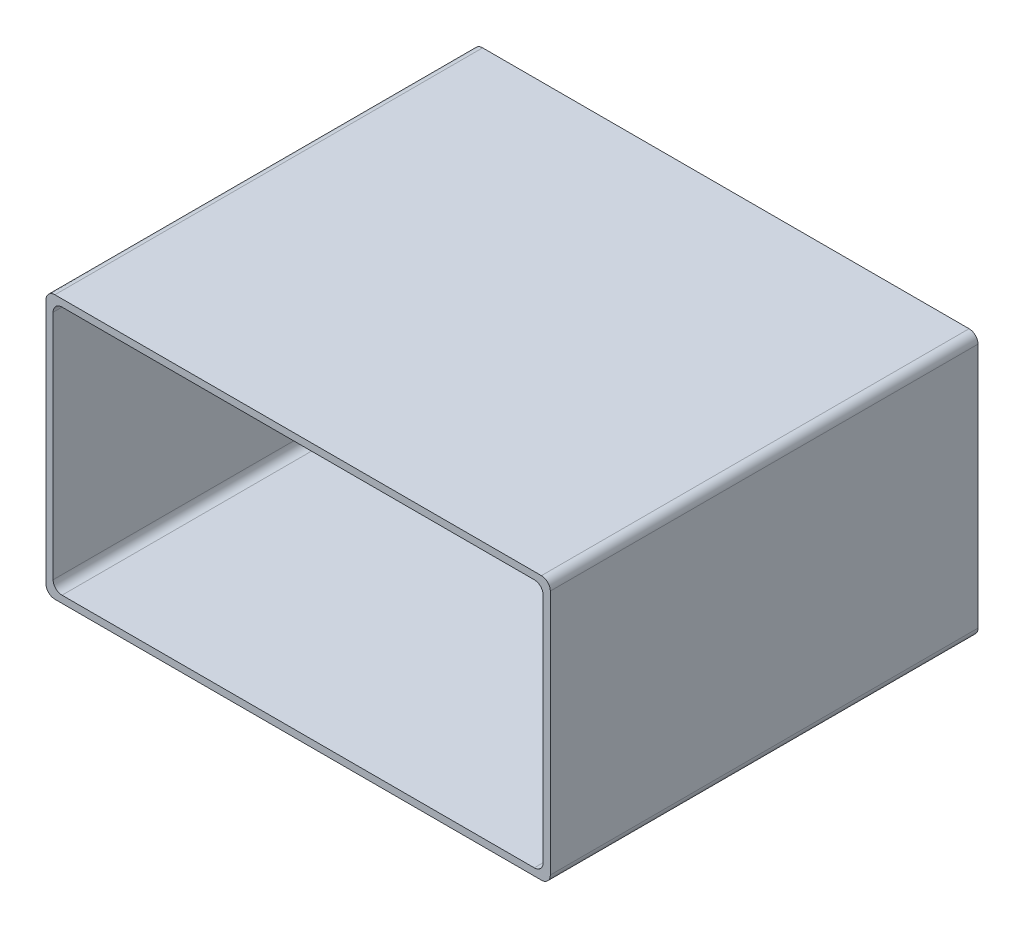
ISO-10303-21;
HEADER;
FILE_DESCRIPTION(('STEP AP214'),'2;1');
FILE_NAME('part.step','',(''),(''),'','','');
FILE_SCHEMA(('AUTOMOTIVE_DESIGN { 1 0 10303 214 1 1 1 1 }'));
ENDSEC;
DATA;
#1=APPLICATION_CONTEXT('core data for automotive mechanical design processes');
#2=APPLICATION_PROTOCOL_DEFINITION('international standard','automotive_design',2000,#1);
#3=PRODUCT_CONTEXT('',#1,'mechanical');
#4=PRODUCT('Part','Part','',(#3));
#5=PRODUCT_RELATED_PRODUCT_CATEGORY('part','',(#4));
#6=PRODUCT_DEFINITION_FORMATION('','',#4);
#7=PRODUCT_DEFINITION_CONTEXT('part definition',#1,'design');
#8=PRODUCT_DEFINITION('design','',#6,#7);
#9=PRODUCT_DEFINITION_SHAPE('','',#8);
#10=(LENGTH_UNIT() NAMED_UNIT(*) SI_UNIT(.MILLI.,.METRE.));
#11=(NAMED_UNIT(*) PLANE_ANGLE_UNIT() SI_UNIT($,.RADIAN.));
#12=(NAMED_UNIT(*) SI_UNIT($,.STERADIAN.) SOLID_ANGLE_UNIT());
#13=UNCERTAINTY_MEASURE_WITH_UNIT(LENGTH_MEASURE(1.E-05),#10,'distance_accuracy_value','');
#14=(GEOMETRIC_REPRESENTATION_CONTEXT(3) GLOBAL_UNCERTAINTY_ASSIGNED_CONTEXT((#13)) GLOBAL_UNIT_ASSIGNED_CONTEXT((#10,
#11,#12)) REPRESENTATION_CONTEXT('',''));
#15=CARTESIAN_POINT('',(0.,0.,0.));
#16=DIRECTION('',(0.,0.,1.));
#17=DIRECTION('',(1.,0.,0.));
#18=AXIS2_PLACEMENT_3D('',#15,#16,#17);
#19=CARTESIAN_POINT('',(0.,0.,48.));
#20=DIRECTION('',(0.,0.,1.));
#21=DIRECTION('',(1.,0.,0.));
#22=AXIS2_PLACEMENT_3D('',#19,#20,#21);
#23=PLANE('',#22);
#24=DIRECTION('',(1.,0.,0.));
#25=VECTOR('',#24,1.);
#26=CARTESIAN_POINT('',(-28.3,-14.8,48.));
#27=LINE('',#26,#25);
#28=CARTESIAN_POINT('',(-27.3,-14.8,48.));
#29=VERTEX_POINT('',#28);
#30=CARTESIAN_POINT('',(27.3,-14.8,48.));
#31=VERTEX_POINT('',#30);
#32=EDGE_CURVE('E271',#29,#31,#27,.T.);
#33=ORIENTED_EDGE('',*,*,#32,.T.);
#34=CARTESIAN_POINT('',(27.3,-13.8,48.));
#35=DIRECTION('',(0.,0.,1.));
#36=DIRECTION('',(1.,0.,0.));
#37=AXIS2_PLACEMENT_3D('',#34,#35,#36);
#38=CIRCLE('',#37,1.);
#39=CARTESIAN_POINT('',(28.3,-13.8,48.));
#40=VERTEX_POINT('',#39);
#41=EDGE_CURVE('E218',#31,#40,#38,.T.);
#42=ORIENTED_EDGE('',*,*,#41,.T.);
#43=DIRECTION('',(0.,1.,0.));
#44=VECTOR('',#43,1.);
#45=CARTESIAN_POINT('',(28.3,14.8,48.));
#46=LINE('',#45,#44);
#47=CARTESIAN_POINT('',(28.3,13.8,48.));
#48=VERTEX_POINT('',#47);
#49=EDGE_CURVE('E176',#40,#48,#46,.T.);
#50=ORIENTED_EDGE('',*,*,#49,.T.);
#51=CARTESIAN_POINT('',(27.3,13.8,48.));
#52=DIRECTION('',(0.,0.,1.));
#53=DIRECTION('',(1.,0.,0.));
#54=AXIS2_PLACEMENT_3D('',#51,#52,#53);
#55=CIRCLE('',#54,1.);
#56=CARTESIAN_POINT('',(27.3,14.8,48.));
#57=VERTEX_POINT('',#56);
#58=EDGE_CURVE('E57',#48,#57,#55,.T.);
#59=ORIENTED_EDGE('',*,*,#58,.T.);
#60=DIRECTION('',(-1.,0.,0.));
#61=VECTOR('',#60,1.);
#62=CARTESIAN_POINT('',(-28.3,14.8,48.));
#63=LINE('',#62,#61);
#64=CARTESIAN_POINT('',(-27.3,14.8,48.));
#65=VERTEX_POINT('',#64);
#66=EDGE_CURVE('E172',#57,#65,#63,.T.);
#67=ORIENTED_EDGE('',*,*,#66,.T.);
#68=CARTESIAN_POINT('',(-27.3,13.8,48.));
#69=DIRECTION('',(0.,0.,1.));
#70=DIRECTION('',(1.,0.,0.));
#71=AXIS2_PLACEMENT_3D('',#68,#69,#70);
#72=CIRCLE('',#71,1.);
#73=CARTESIAN_POINT('',(-28.3,13.8,48.));
#74=VERTEX_POINT('',#73);
#75=EDGE_CURVE('E214',#65,#74,#72,.T.);
#76=ORIENTED_EDGE('',*,*,#75,.T.);
#77=DIRECTION('',(0.,-1.,0.));
#78=VECTOR('',#77,1.);
#79=CARTESIAN_POINT('',(-28.3,14.8,48.));
#80=LINE('',#79,#78);
#81=CARTESIAN_POINT('',(-28.3,-13.8,48.));
#82=VERTEX_POINT('',#81);
#83=EDGE_CURVE('E268',#74,#82,#80,.T.);
#84=ORIENTED_EDGE('',*,*,#83,.T.);
#85=CARTESIAN_POINT('',(-27.3,-13.8,48.));
#86=DIRECTION('',(0.,0.,1.));
#87=DIRECTION('',(1.,0.,0.));
#88=AXIS2_PLACEMENT_3D('',#85,#86,#87);
#89=CIRCLE('',#88,1.);
#90=EDGE_CURVE('E216',#82,#29,#89,.T.);
#91=ORIENTED_EDGE('',*,*,#90,.T.);
#92=EDGE_LOOP('',(#33,#42,#50,#59,#67,#76,#84,#91));
#93=FACE_BOUND('',#92,.T.);
#94=DIRECTION('',(-1.,0.,0.));
#95=VECTOR('',#94,1.);
#96=CARTESIAN_POINT('',(-27.5,14.,48.));
#97=LINE('',#96,#95);
#98=CARTESIAN_POINT('',(26.5,14.,48.));
#99=VERTEX_POINT('',#98);
#100=CARTESIAN_POINT('',(-26.5,14.,48.));
#101=VERTEX_POINT('',#100);
#102=EDGE_CURVE('E467',#99,#101,#97,.T.);
#103=ORIENTED_EDGE('',*,*,#102,.F.);
#104=CARTESIAN_POINT('',(26.5,13.,48.));
#105=DIRECTION('',(0.,0.,1.));
#106=DIRECTION('',(1.,0.,0.));
#107=AXIS2_PLACEMENT_3D('',#104,#105,#106);
#108=CIRCLE('',#107,1.);
#109=CARTESIAN_POINT('',(27.5,13.,48.));
#110=VERTEX_POINT('',#109);
#111=EDGE_CURVE('E11',#99,#110,#108,.F.);
#112=ORIENTED_EDGE('',*,*,#111,.T.);
#113=DIRECTION('',(0.,1.,0.));
#114=VECTOR('',#113,1.);
#115=CARTESIAN_POINT('',(27.5,14.,48.));
#116=LINE('',#115,#114);
#117=CARTESIAN_POINT('',(27.5,-13.,48.));
#118=VERTEX_POINT('',#117);
#119=EDGE_CURVE('E247',#118,#110,#116,.T.);
#120=ORIENTED_EDGE('',*,*,#119,.F.);
#121=CARTESIAN_POINT('',(26.5,-13.,48.));
#122=DIRECTION('',(0.,0.,1.));
#123=DIRECTION('',(1.,0.,0.));
#124=AXIS2_PLACEMENT_3D('',#121,#122,#123);
#125=CIRCLE('',#124,1.);
#126=CARTESIAN_POINT('',(26.5,-14.,48.));
#127=VERTEX_POINT('',#126);
#128=EDGE_CURVE('E159',#118,#127,#125,.F.);
#129=ORIENTED_EDGE('',*,*,#128,.T.);
#130=DIRECTION('',(1.,0.,0.));
#131=VECTOR('',#130,1.);
#132=CARTESIAN_POINT('',(-27.5,-14.,48.));
#133=LINE('',#132,#131);
#134=CARTESIAN_POINT('',(-26.5,-14.,48.));
#135=VERTEX_POINT('',#134);
#136=EDGE_CURVE('E244',#135,#127,#133,.T.);
#137=ORIENTED_EDGE('',*,*,#136,.F.);
#138=CARTESIAN_POINT('',(-26.5,-13.,48.));
#139=DIRECTION('',(0.,0.,1.));
#140=DIRECTION('',(1.,0.,0.));
#141=AXIS2_PLACEMENT_3D('',#138,#139,#140);
#142=CIRCLE('',#141,1.);
#143=CARTESIAN_POINT('',(-27.5,-13.,48.));
#144=VERTEX_POINT('',#143);
#145=EDGE_CURVE('E235',#135,#144,#142,.F.);
#146=ORIENTED_EDGE('',*,*,#145,.T.);
#147=DIRECTION('',(0.,-1.,0.));
#148=VECTOR('',#147,1.);
#149=CARTESIAN_POINT('',(-27.5,14.,48.));
#150=LINE('',#149,#148);
#151=CARTESIAN_POINT('',(-27.5,13.,48.));
#152=VERTEX_POINT('',#151);
#153=EDGE_CURVE('E256',#152,#144,#150,.T.);
#154=ORIENTED_EDGE('',*,*,#153,.F.);
#155=CARTESIAN_POINT('',(-26.5,13.,48.));
#156=DIRECTION('',(0.,0.,1.));
#157=DIRECTION('',(1.,0.,0.));
#158=AXIS2_PLACEMENT_3D('',#155,#156,#157);
#159=CIRCLE('',#158,1.);
#160=EDGE_CURVE('E231',#152,#101,#159,.F.);
#161=ORIENTED_EDGE('',*,*,#160,.T.);
#162=EDGE_LOOP('',(#103,#112,#120,#129,#137,#146,#154,#161));
#163=FACE_BOUND('',#162,.T.);
#164=ADVANCED_FACE('F35',(#93,#163),#23,.T.);
#165=CARTESIAN_POINT('',(0.,0.,0.));
#166=DIRECTION('',(0.,0.,1.));
#167=DIRECTION('',(1.,0.,0.));
#168=AXIS2_PLACEMENT_3D('',#165,#166,#167);
#169=PLANE('',#168);
#170=DIRECTION('',(0.,1.,0.));
#171=VECTOR('',#170,1.);
#172=CARTESIAN_POINT('',(28.3,14.8,0.));
#173=LINE('',#172,#171);
#174=CARTESIAN_POINT('',(28.3,-13.8,0.));
#175=VERTEX_POINT('',#174);
#176=CARTESIAN_POINT('',(28.3,13.8,0.));
#177=VERTEX_POINT('',#176);
#178=EDGE_CURVE('E279',#175,#177,#173,.T.);
#179=ORIENTED_EDGE('',*,*,#178,.F.);
#180=CARTESIAN_POINT('',(27.3,-13.8,0.));
#181=DIRECTION('',(0.,0.,1.));
#182=DIRECTION('',(1.,0.,0.));
#183=AXIS2_PLACEMENT_3D('',#180,#181,#182);
#184=CIRCLE('',#183,1.);
#185=CARTESIAN_POINT('',(27.3,-14.8,0.));
#186=VERTEX_POINT('',#185);
#187=EDGE_CURVE('E206',#175,#186,#184,.F.);
#188=ORIENTED_EDGE('',*,*,#187,.T.);
#189=DIRECTION('',(1.,0.,0.));
#190=VECTOR('',#189,1.);
#191=CARTESIAN_POINT('',(-28.3,-14.8,0.));
#192=LINE('',#191,#190);
#193=CARTESIAN_POINT('',(-27.3,-14.8,0.));
#194=VERTEX_POINT('',#193);
#195=EDGE_CURVE('E277',#194,#186,#192,.T.);
#196=ORIENTED_EDGE('',*,*,#195,.F.);
#197=CARTESIAN_POINT('',(-27.3,-13.8,0.));
#198=DIRECTION('',(0.,0.,1.));
#199=DIRECTION('',(1.,0.,0.));
#200=AXIS2_PLACEMENT_3D('',#197,#198,#199);
#201=CIRCLE('',#200,1.);
#202=CARTESIAN_POINT('',(-28.3,-13.8,0.));
#203=VERTEX_POINT('',#202);
#204=EDGE_CURVE('E204',#194,#203,#201,.F.);
#205=ORIENTED_EDGE('',*,*,#204,.T.);
#206=DIRECTION('',(0.,-1.,0.));
#207=VECTOR('',#206,1.);
#208=CARTESIAN_POINT('',(-28.3,14.8,0.));
#209=LINE('',#208,#207);
#210=CARTESIAN_POINT('',(-28.3,13.8,0.));
#211=VERTEX_POINT('',#210);
#212=EDGE_CURVE('E255',#211,#203,#209,.T.);
#213=ORIENTED_EDGE('',*,*,#212,.F.);
#214=CARTESIAN_POINT('',(-27.3,13.8,0.));
#215=DIRECTION('',(0.,0.,1.));
#216=DIRECTION('',(1.,0.,0.));
#217=AXIS2_PLACEMENT_3D('',#214,#215,#216);
#218=CIRCLE('',#217,1.);
#219=CARTESIAN_POINT('',(-27.3,14.8,0.));
#220=VERTEX_POINT('',#219);
#221=EDGE_CURVE('E202',#211,#220,#218,.F.);
#222=ORIENTED_EDGE('',*,*,#221,.T.);
#223=DIRECTION('',(-1.,0.,0.));
#224=VECTOR('',#223,1.);
#225=CARTESIAN_POINT('',(-28.3,14.8,0.));
#226=LINE('',#225,#224);
#227=CARTESIAN_POINT('',(27.3,14.8,0.));
#228=VERTEX_POINT('',#227);
#229=EDGE_CURVE('E179',#228,#220,#226,.T.);
#230=ORIENTED_EDGE('',*,*,#229,.F.);
#231=CARTESIAN_POINT('',(27.3,13.8,0.));
#232=DIRECTION('',(0.,0.,1.));
#233=DIRECTION('',(1.,0.,0.));
#234=AXIS2_PLACEMENT_3D('',#231,#232,#233);
#235=CIRCLE('',#234,1.);
#236=EDGE_CURVE('E200',#228,#177,#235,.F.);
#237=ORIENTED_EDGE('',*,*,#236,.T.);
#238=EDGE_LOOP('',(#179,#188,#196,#205,#213,#222,#230,#237));
#239=FACE_BOUND('',#238,.T.);
#240=DIRECTION('',(1.,0.,0.));
#241=VECTOR('',#240,1.);
#242=CARTESIAN_POINT('',(-27.5,-14.,0.));
#243=LINE('',#242,#241);
#244=CARTESIAN_POINT('',(-26.5,-14.,0.));
#245=VERTEX_POINT('',#244);
#246=CARTESIAN_POINT('',(26.5,-14.,0.));
#247=VERTEX_POINT('',#246);
#248=EDGE_CURVE('E259',#245,#247,#243,.T.);
#249=ORIENTED_EDGE('',*,*,#248,.T.);
#250=CARTESIAN_POINT('',(26.5,-13.,0.));
#251=DIRECTION('',(0.,0.,1.));
#252=DIRECTION('',(1.,0.,0.));
#253=AXIS2_PLACEMENT_3D('',#250,#251,#252);
#254=CIRCLE('',#253,1.);
#255=CARTESIAN_POINT('',(27.5,-13.,0.));
#256=VERTEX_POINT('',#255);
#257=EDGE_CURVE('E237',#247,#256,#254,.T.);
#258=ORIENTED_EDGE('',*,*,#257,.T.);
#259=DIRECTION('',(0.,1.,0.));
#260=VECTOR('',#259,1.);
#261=CARTESIAN_POINT('',(27.5,14.,0.));
#262=LINE('',#261,#260);
#263=CARTESIAN_POINT('',(27.5,13.,0.));
#264=VERTEX_POINT('',#263);
#265=EDGE_CURVE('E154',#256,#264,#262,.T.);
#266=ORIENTED_EDGE('',*,*,#265,.T.);
#267=CARTESIAN_POINT('',(26.5,13.,0.));
#268=DIRECTION('',(0.,0.,1.));
#269=DIRECTION('',(1.,0.,0.));
#270=AXIS2_PLACEMENT_3D('',#267,#268,#269);
#271=CIRCLE('',#270,1.);
#272=CARTESIAN_POINT('',(26.5,14.,0.));
#273=VERTEX_POINT('',#272);
#274=EDGE_CURVE('E43',#264,#273,#271,.T.);
#275=ORIENTED_EDGE('',*,*,#274,.T.);
#276=DIRECTION('',(-1.,0.,0.));
#277=VECTOR('',#276,1.);
#278=CARTESIAN_POINT('',(-27.5,14.,0.));
#279=LINE('',#278,#277);
#280=CARTESIAN_POINT('',(-26.5,14.,0.));
#281=VERTEX_POINT('',#280);
#282=EDGE_CURVE('E152',#273,#281,#279,.T.);
#283=ORIENTED_EDGE('',*,*,#282,.T.);
#284=CARTESIAN_POINT('',(-26.5,13.,0.));
#285=DIRECTION('',(0.,0.,1.));
#286=DIRECTION('',(1.,0.,0.));
#287=AXIS2_PLACEMENT_3D('',#284,#285,#286);
#288=CIRCLE('',#287,1.);
#289=CARTESIAN_POINT('',(-27.5,13.,0.));
#290=VERTEX_POINT('',#289);
#291=EDGE_CURVE('E229',#281,#290,#288,.T.);
#292=ORIENTED_EDGE('',*,*,#291,.T.);
#293=DIRECTION('',(0.,-1.,0.));
#294=VECTOR('',#293,1.);
#295=CARTESIAN_POINT('',(-27.5,14.,0.));
#296=LINE('',#295,#294);
#297=CARTESIAN_POINT('',(-27.5,-13.,0.));
#298=VERTEX_POINT('',#297);
#299=EDGE_CURVE('E168',#290,#298,#296,.T.);
#300=ORIENTED_EDGE('',*,*,#299,.T.);
#301=CARTESIAN_POINT('',(-26.5,-13.,0.));
#302=DIRECTION('',(0.,0.,1.));
#303=DIRECTION('',(1.,0.,0.));
#304=AXIS2_PLACEMENT_3D('',#301,#302,#303);
#305=CIRCLE('',#304,1.);
#306=EDGE_CURVE('E233',#298,#245,#305,.T.);
#307=ORIENTED_EDGE('',*,*,#306,.T.);
#308=EDGE_LOOP('',(#249,#258,#266,#275,#283,#292,#300,#307));
#309=FACE_BOUND('',#308,.T.);
#310=ADVANCED_FACE('F151',(#239,#309),#169,.F.);
#311=CARTESIAN_POINT('',(-28.3,14.8,48.));
#312=DIRECTION('',(1.,0.,0.));
#313=DIRECTION('',(0.,1.,0.));
#314=AXIS2_PLACEMENT_3D('',#311,#312,#313);
#315=PLANE('',#314);
#316=ORIENTED_EDGE('',*,*,#212,.T.);
#317=DIRECTION('',(0.,0.,-1.));
#318=VECTOR('',#317,1.);
#319=CARTESIAN_POINT('',(-28.3,-13.8,48.));
#320=LINE('',#319,#318);
#321=EDGE_CURVE('E223',#203,#82,#320,.F.);
#322=ORIENTED_EDGE('',*,*,#321,.T.);
#323=ORIENTED_EDGE('',*,*,#83,.F.);
#324=DIRECTION('',(0.,0.,-1.));
#325=VECTOR('',#324,1.);
#326=CARTESIAN_POINT('',(-28.3,13.8,48.));
#327=LINE('',#326,#325);
#328=EDGE_CURVE('E220',#74,#211,#327,.T.);
#329=ORIENTED_EDGE('',*,*,#328,.T.);
#330=EDGE_LOOP('',(#316,#322,#323,#329));
#331=FACE_BOUND('',#330,.T.);
#332=ADVANCED_FACE('F295',(#331),#315,.F.);
#333=CARTESIAN_POINT('',(-28.3,-14.8,48.));
#334=DIRECTION('',(0.,1.,0.));
#335=DIRECTION('',(0.,0.,1.));
#336=AXIS2_PLACEMENT_3D('',#333,#334,#335);
#337=PLANE('',#336);
#338=ORIENTED_EDGE('',*,*,#195,.T.);
#339=DIRECTION('',(0.,0.,-1.));
#340=VECTOR('',#339,1.);
#341=CARTESIAN_POINT('',(27.3,-14.8,48.));
#342=LINE('',#341,#340);
#343=EDGE_CURVE('E211',#186,#31,#342,.F.);
#344=ORIENTED_EDGE('',*,*,#343,.T.);
#345=ORIENTED_EDGE('',*,*,#32,.F.);
#346=DIRECTION('',(0.,0.,-1.));
#347=VECTOR('',#346,1.);
#348=CARTESIAN_POINT('',(-27.3,-14.8,48.));
#349=LINE('',#348,#347);
#350=EDGE_CURVE('E208',#29,#194,#349,.T.);
#351=ORIENTED_EDGE('',*,*,#350,.T.);
#352=EDGE_LOOP('',(#338,#344,#345,#351));
#353=FACE_BOUND('',#352,.T.);
#354=ADVANCED_FACE('F304',(#353),#337,.F.);
#355=CARTESIAN_POINT('',(28.3,14.8,48.));
#356=DIRECTION('',(-1.,0.,0.));
#357=DIRECTION('',(0.,-1.,0.));
#358=AXIS2_PLACEMENT_3D('',#355,#356,#357);
#359=PLANE('',#358);
#360=ORIENTED_EDGE('',*,*,#49,.F.);
#361=DIRECTION('',(0.,0.,-1.));
#362=VECTOR('',#361,1.);
#363=CARTESIAN_POINT('',(28.3,-13.8,48.));
#364=LINE('',#363,#362);
#365=EDGE_CURVE('E197',#40,#175,#364,.T.);
#366=ORIENTED_EDGE('',*,*,#365,.T.);
#367=ORIENTED_EDGE('',*,*,#178,.T.);
#368=DIRECTION('',(0.,0.,-1.));
#369=VECTOR('',#368,1.);
#370=CARTESIAN_POINT('',(28.3,13.8,48.));
#371=LINE('',#370,#369);
#372=EDGE_CURVE('E195',#177,#48,#371,.F.);
#373=ORIENTED_EDGE('',*,*,#372,.T.);
#374=EDGE_LOOP('',(#360,#366,#367,#373));
#375=FACE_BOUND('',#374,.T.);
#376=ADVANCED_FACE('F311',(#375),#359,.F.);
#377=CARTESIAN_POINT('',(-28.3,14.8,48.));
#378=DIRECTION('',(0.,-1.,0.));
#379=DIRECTION('',(0.,0.,-1.));
#380=AXIS2_PLACEMENT_3D('',#377,#378,#379);
#381=PLANE('',#380);
#382=ORIENTED_EDGE('',*,*,#229,.T.);
#383=DIRECTION('',(0.,0.,-1.));
#384=VECTOR('',#383,1.);
#385=CARTESIAN_POINT('',(-27.3,14.8,48.));
#386=LINE('',#385,#384);
#387=EDGE_CURVE('E50',#220,#65,#386,.F.);
#388=ORIENTED_EDGE('',*,*,#387,.T.);
#389=ORIENTED_EDGE('',*,*,#66,.F.);
#390=DIRECTION('',(0.,0.,-1.));
#391=VECTOR('',#390,1.);
#392=CARTESIAN_POINT('',(27.3,14.8,48.));
#393=LINE('',#392,#391);
#394=EDGE_CURVE('E225',#57,#228,#393,.T.);
#395=ORIENTED_EDGE('',*,*,#394,.T.);
#396=EDGE_LOOP('',(#382,#388,#389,#395));
#397=FACE_BOUND('',#396,.T.);
#398=ADVANCED_FACE('F285',(#397),#381,.F.);
#399=CARTESIAN_POINT('',(27.5,14.,48.));
#400=DIRECTION('',(-1.,0.,0.));
#401=DIRECTION('',(0.,-1.,0.));
#402=AXIS2_PLACEMENT_3D('',#399,#400,#401);
#403=PLANE('',#402);
#404=ORIENTED_EDGE('',*,*,#265,.F.);
#405=DIRECTION('',(0.,0.,-1.));
#406=VECTOR('',#405,1.);
#407=CARTESIAN_POINT('',(27.5,-13.,48.));
#408=LINE('',#407,#406);
#409=EDGE_CURVE('E193',#256,#118,#408,.F.);
#410=ORIENTED_EDGE('',*,*,#409,.T.);
#411=ORIENTED_EDGE('',*,*,#119,.T.);
#412=DIRECTION('',(0.,0.,-1.));
#413=VECTOR('',#412,1.);
#414=CARTESIAN_POINT('',(27.5,13.,0.));
#415=LINE('',#414,#413);
#416=EDGE_CURVE('E191',#110,#264,#415,.T.);
#417=ORIENTED_EDGE('',*,*,#416,.T.);
#418=EDGE_LOOP('',(#404,#410,#411,#417));
#419=FACE_BOUND('',#418,.T.);
#420=ADVANCED_FACE('F261',(#419),#403,.T.);
#421=CARTESIAN_POINT('',(-27.5,14.,48.));
#422=DIRECTION('',(0.,-1.,0.));
#423=DIRECTION('',(0.,0.,-1.));
#424=AXIS2_PLACEMENT_3D('',#421,#422,#423);
#425=PLANE('',#424);
#426=ORIENTED_EDGE('',*,*,#102,.T.);
#427=DIRECTION('',(0.,0.,-1.));
#428=VECTOR('',#427,1.);
#429=CARTESIAN_POINT('',(-26.5,14.,0.));
#430=LINE('',#429,#428);
#431=EDGE_CURVE('E167',#101,#281,#430,.T.);
#432=ORIENTED_EDGE('',*,*,#431,.T.);
#433=ORIENTED_EDGE('',*,*,#282,.F.);
#434=DIRECTION('',(0.,0.,-1.));
#435=VECTOR('',#434,1.);
#436=CARTESIAN_POINT('',(26.5,14.,48.));
#437=LINE('',#436,#435);
#438=EDGE_CURVE('E164',#273,#99,#437,.F.);
#439=ORIENTED_EDGE('',*,*,#438,.T.);
#440=EDGE_LOOP('',(#426,#432,#433,#439));
#441=FACE_BOUND('',#440,.T.);
#442=ADVANCED_FACE('F163',(#441),#425,.T.);
#443=CARTESIAN_POINT('',(-27.5,14.,48.));
#444=DIRECTION('',(1.,0.,0.));
#445=DIRECTION('',(0.,1.,0.));
#446=AXIS2_PLACEMENT_3D('',#443,#444,#445);
#447=PLANE('',#446);
#448=ORIENTED_EDGE('',*,*,#299,.F.);
#449=DIRECTION('',(0.,0.,-1.));
#450=VECTOR('',#449,1.);
#451=CARTESIAN_POINT('',(-27.5,13.,48.));
#452=LINE('',#451,#450);
#453=EDGE_CURVE('E184',#290,#152,#452,.F.);
#454=ORIENTED_EDGE('',*,*,#453,.T.);
#455=ORIENTED_EDGE('',*,*,#153,.T.);
#456=DIRECTION('',(0.,0.,-1.));
#457=VECTOR('',#456,1.);
#458=CARTESIAN_POINT('',(-27.5,-13.,0.));
#459=LINE('',#458,#457);
#460=EDGE_CURVE('E174',#144,#298,#459,.T.);
#461=ORIENTED_EDGE('',*,*,#460,.T.);
#462=EDGE_LOOP('',(#448,#454,#455,#461));
#463=FACE_BOUND('',#462,.T.);
#464=ADVANCED_FACE('F399',(#463),#447,.T.);
#465=CARTESIAN_POINT('',(-27.5,-14.,48.));
#466=DIRECTION('',(0.,1.,0.));
#467=DIRECTION('',(0.,0.,1.));
#468=AXIS2_PLACEMENT_3D('',#465,#466,#467);
#469=PLANE('',#468);
#470=ORIENTED_EDGE('',*,*,#248,.F.);
#471=DIRECTION('',(0.,0.,-1.));
#472=VECTOR('',#471,1.);
#473=CARTESIAN_POINT('',(-26.5,-14.,48.));
#474=LINE('',#473,#472);
#475=EDGE_CURVE('E189',#245,#135,#474,.F.);
#476=ORIENTED_EDGE('',*,*,#475,.T.);
#477=ORIENTED_EDGE('',*,*,#136,.T.);
#478=DIRECTION('',(0.,0.,-1.));
#479=VECTOR('',#478,1.);
#480=CARTESIAN_POINT('',(26.5,-14.,0.));
#481=LINE('',#480,#479);
#482=EDGE_CURVE('E186',#127,#247,#481,.T.);
#483=ORIENTED_EDGE('',*,*,#482,.T.);
#484=EDGE_LOOP('',(#470,#476,#477,#483));
#485=FACE_BOUND('',#484,.T.);
#486=ADVANCED_FACE('F253',(#485),#469,.T.);
#487=CARTESIAN_POINT('',(-26.5,13.,48.));
#488=DIRECTION('',(0.,0.,1.));
#489=DIRECTION('',(1.,0.,0.));
#490=AXIS2_PLACEMENT_3D('',#487,#488,#489);
#491=CYLINDRICAL_SURFACE('',#490,1.);
#492=ORIENTED_EDGE('',*,*,#160,.F.);
#493=ORIENTED_EDGE('',*,*,#453,.F.);
#494=ORIENTED_EDGE('',*,*,#291,.F.);
#495=ORIENTED_EDGE('',*,*,#431,.F.);
#496=EDGE_LOOP('',(#492,#493,#494,#495));
#497=FACE_BOUND('',#496,.T.);
#498=ADVANCED_FACE('F329',(#497),#491,.F.);
#499=CARTESIAN_POINT('',(-26.5,-13.,48.));
#500=DIRECTION('',(0.,0.,1.));
#501=DIRECTION('',(1.,0.,0.));
#502=AXIS2_PLACEMENT_3D('',#499,#500,#501);
#503=CYLINDRICAL_SURFACE('',#502,1.);
#504=ORIENTED_EDGE('',*,*,#145,.F.);
#505=ORIENTED_EDGE('',*,*,#475,.F.);
#506=ORIENTED_EDGE('',*,*,#306,.F.);
#507=ORIENTED_EDGE('',*,*,#460,.F.);
#508=EDGE_LOOP('',(#504,#505,#506,#507));
#509=FACE_BOUND('',#508,.T.);
#510=ADVANCED_FACE('F332',(#509),#503,.F.);
#511=CARTESIAN_POINT('',(26.5,-13.,48.));
#512=DIRECTION('',(0.,0.,1.));
#513=DIRECTION('',(1.,0.,0.));
#514=AXIS2_PLACEMENT_3D('',#511,#512,#513);
#515=CYLINDRICAL_SURFACE('',#514,1.);
#516=ORIENTED_EDGE('',*,*,#128,.F.);
#517=ORIENTED_EDGE('',*,*,#409,.F.);
#518=ORIENTED_EDGE('',*,*,#257,.F.);
#519=ORIENTED_EDGE('',*,*,#482,.F.);
#520=EDGE_LOOP('',(#516,#517,#518,#519));
#521=FACE_BOUND('',#520,.T.);
#522=ADVANCED_FACE('F258',(#521),#515,.F.);
#523=CARTESIAN_POINT('',(26.5,13.,48.));
#524=DIRECTION('',(0.,0.,1.));
#525=DIRECTION('',(1.,0.,0.));
#526=AXIS2_PLACEMENT_3D('',#523,#524,#525);
#527=CYLINDRICAL_SURFACE('',#526,1.);
#528=ORIENTED_EDGE('',*,*,#111,.F.);
#529=ORIENTED_EDGE('',*,*,#438,.F.);
#530=ORIENTED_EDGE('',*,*,#274,.F.);
#531=ORIENTED_EDGE('',*,*,#416,.F.);
#532=EDGE_LOOP('',(#528,#529,#530,#531));
#533=FACE_BOUND('',#532,.T.);
#534=ADVANCED_FACE('F171',(#533),#527,.F.);
#535=CARTESIAN_POINT('',(27.3,-13.8,48.));
#536=DIRECTION('',(0.,0.,-1.));
#537=DIRECTION('',(-1.,0.,0.));
#538=AXIS2_PLACEMENT_3D('',#535,#536,#537);
#539=CYLINDRICAL_SURFACE('',#538,1.);
#540=ORIENTED_EDGE('',*,*,#41,.F.);
#541=ORIENTED_EDGE('',*,*,#343,.F.);
#542=ORIENTED_EDGE('',*,*,#187,.F.);
#543=ORIENTED_EDGE('',*,*,#365,.F.);
#544=EDGE_LOOP('',(#540,#541,#542,#543));
#545=FACE_BOUND('',#544,.T.);
#546=ADVANCED_FACE('F308',(#545),#539,.T.);
#547=CARTESIAN_POINT('',(-27.3,-13.8,48.));
#548=DIRECTION('',(0.,0.,-1.));
#549=DIRECTION('',(-1.,0.,0.));
#550=AXIS2_PLACEMENT_3D('',#547,#548,#549);
#551=CYLINDRICAL_SURFACE('',#550,1.);
#552=ORIENTED_EDGE('',*,*,#90,.F.);
#553=ORIENTED_EDGE('',*,*,#321,.F.);
#554=ORIENTED_EDGE('',*,*,#204,.F.);
#555=ORIENTED_EDGE('',*,*,#350,.F.);
#556=EDGE_LOOP('',(#552,#553,#554,#555));
#557=FACE_BOUND('',#556,.T.);
#558=ADVANCED_FACE('F299',(#557),#551,.T.);
#559=CARTESIAN_POINT('',(-27.3,13.8,48.));
#560=DIRECTION('',(0.,0.,-1.));
#561=DIRECTION('',(-1.,0.,0.));
#562=AXIS2_PLACEMENT_3D('',#559,#560,#561);
#563=CYLINDRICAL_SURFACE('',#562,1.);
#564=ORIENTED_EDGE('',*,*,#75,.F.);
#565=ORIENTED_EDGE('',*,*,#387,.F.);
#566=ORIENTED_EDGE('',*,*,#221,.F.);
#567=ORIENTED_EDGE('',*,*,#328,.F.);
#568=EDGE_LOOP('',(#564,#565,#566,#567));
#569=FACE_BOUND('',#568,.T.);
#570=ADVANCED_FACE('F290',(#569),#563,.T.);
#571=CARTESIAN_POINT('',(27.3,13.8,48.));
#572=DIRECTION('',(0.,0.,-1.));
#573=DIRECTION('',(-1.,0.,0.));
#574=AXIS2_PLACEMENT_3D('',#571,#572,#573);
#575=CYLINDRICAL_SURFACE('',#574,1.);
#576=ORIENTED_EDGE('',*,*,#58,.F.);
#577=ORIENTED_EDGE('',*,*,#372,.F.);
#578=ORIENTED_EDGE('',*,*,#236,.F.);
#579=ORIENTED_EDGE('',*,*,#394,.F.);
#580=EDGE_LOOP('',(#576,#577,#578,#579));
#581=FACE_BOUND('',#580,.T.);
#582=ADVANCED_FACE('F37',(#581),#575,.T.);
#583=CLOSED_SHELL('',(#164,#310,#332,#354,#376,#398,#420,#442,#464,#486,#498,#510,#522,#534,
#546,#558,#570,#582));
#584=MANIFOLD_SOLID_BREP('B2',#583);
#585=ADVANCED_BREP_SHAPE_REPRESENTATION('',(#18,#584),#14);
#586=SHAPE_DEFINITION_REPRESENTATION(#9,#585);
ENDSEC;
END-ISO-10303-21;
